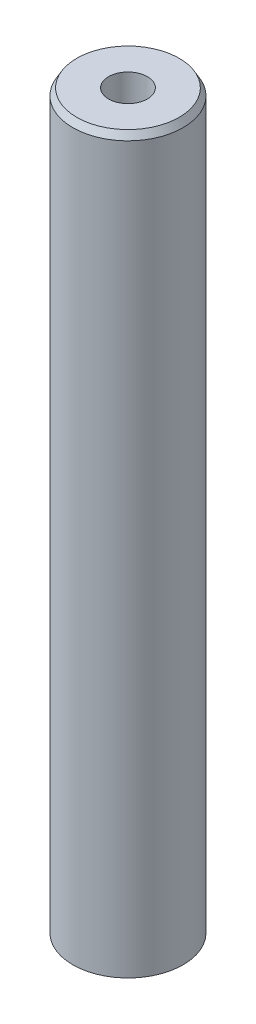
ISO-10303-21;
HEADER;
FILE_DESCRIPTION(('STEP AP214'),'2;1');
FILE_NAME('part.step','',(''),(''),'','','');
FILE_SCHEMA(('AUTOMOTIVE_DESIGN { 1 0 10303 214 1 1 1 1 }'));
ENDSEC;
DATA;
#1=APPLICATION_CONTEXT('core data for automotive mechanical design processes');
#2=APPLICATION_PROTOCOL_DEFINITION('international standard','automotive_design',2000,#1);
#3=PRODUCT_CONTEXT('',#1,'mechanical');
#4=PRODUCT('Part','Part','',(#3));
#5=PRODUCT_RELATED_PRODUCT_CATEGORY('part','',(#4));
#6=PRODUCT_DEFINITION_FORMATION('','',#4);
#7=PRODUCT_DEFINITION_CONTEXT('part definition',#1,'design');
#8=PRODUCT_DEFINITION('design','',#6,#7);
#9=PRODUCT_DEFINITION_SHAPE('','',#8);
#10=(LENGTH_UNIT() NAMED_UNIT(*) SI_UNIT(.MILLI.,.METRE.));
#11=(NAMED_UNIT(*) PLANE_ANGLE_UNIT() SI_UNIT($,.RADIAN.));
#12=(NAMED_UNIT(*) SI_UNIT($,.STERADIAN.) SOLID_ANGLE_UNIT());
#13=UNCERTAINTY_MEASURE_WITH_UNIT(LENGTH_MEASURE(1.E-05),#10,'distance_accuracy_value','');
#14=(GEOMETRIC_REPRESENTATION_CONTEXT(3) GLOBAL_UNCERTAINTY_ASSIGNED_CONTEXT((#13)) GLOBAL_UNIT_ASSIGNED_CONTEXT((#10,
#11,#12)) REPRESENTATION_CONTEXT('',''));
#15=CARTESIAN_POINT('',(0.,0.,0.));
#16=DIRECTION('',(0.,0.,1.));
#17=DIRECTION('',(1.,0.,0.));
#18=AXIS2_PLACEMENT_3D('',#15,#16,#17);
#19=CARTESIAN_POINT('',(0.,600.,0.));
#20=DIRECTION('',(0.,-1.,0.));
#21=DIRECTION('',(0.,0.,-1.));
#22=AXIS2_PLACEMENT_3D('',#19,#20,#21);
#23=CYLINDRICAL_SURFACE('',#22,45.);
#24=CARTESIAN_POINT('',(0.,594.360513745345,0.));
#25=DIRECTION('',(0.,1.,0.));
#26=DIRECTION('',(0.,0.,1.));
#27=AXIS2_PLACEMENT_3D('',#24,#25,#26);
#28=CIRCLE('',#27,45.);
#29=CARTESIAN_POINT('',(0.,594.360513745345,45.));
#30=VERTEX_POINT('',#29);
#31=EDGE_CURVE('E50',#30,#30,#28,.F.);
#32=ORIENTED_EDGE('',*,*,#31,.T.);
#33=EDGE_LOOP('',(#32));
#34=FACE_BOUND('',#33,.T.);
#35=CARTESIAN_POINT('',(0.,3.25595890721653,0.));
#36=DIRECTION('',(0.,1.,0.));
#37=DIRECTION('',(0.,0.,1.));
#38=AXIS2_PLACEMENT_3D('',#35,#36,#37);
#39=CIRCLE('',#38,45.);
#40=CARTESIAN_POINT('',(0.,3.25595890721653,45.));
#41=VERTEX_POINT('',#40);
#42=EDGE_CURVE('E51',#41,#41,#39,.T.);
#43=ORIENTED_EDGE('',*,*,#42,.T.);
#44=EDGE_LOOP('',(#43));
#45=FACE_BOUND('',#44,.T.);
#46=ADVANCED_FACE('F39',(#34,#45),#23,.T.);
#47=CARTESIAN_POINT('',(0.,600.,0.));
#48=DIRECTION('',(0.,1.,0.));
#49=DIRECTION('',(0.,0.,1.));
#50=AXIS2_PLACEMENT_3D('',#47,#48,#49);
#51=PLANE('',#50);
#52=CARTESIAN_POINT('',(0.,600.,0.));
#53=DIRECTION('',(0.,1.,0.));
#54=DIRECTION('',(0.,0.,1.));
#55=AXIS2_PLACEMENT_3D('',#52,#53,#54);
#56=CIRCLE('',#55,41.7440410927835);
#57=CARTESIAN_POINT('',(0.,600.,41.7440410927835));
#58=VERTEX_POINT('',#57);
#59=EDGE_CURVE('E54',#58,#58,#56,.T.);
#60=ORIENTED_EDGE('',*,*,#59,.T.);
#61=EDGE_LOOP('',(#60));
#62=FACE_BOUND('',#61,.T.);
#63=CARTESIAN_POINT('',(0.,600.,0.));
#64=DIRECTION('',(0.,1.,0.));
#65=DIRECTION('',(0.,0.,1.));
#66=AXIS2_PLACEMENT_3D('',#63,#64,#65);
#67=CIRCLE('',#66,15.8198269250848);
#68=CARTESIAN_POINT('',(0.,600.,15.8198269250848));
#69=VERTEX_POINT('',#68);
#70=EDGE_CURVE('E58',#69,#69,#67,.T.);
#71=ORIENTED_EDGE('',*,*,#70,.F.);
#72=EDGE_LOOP('',(#71));
#73=FACE_BOUND('',#72,.T.);
#74=ADVANCED_FACE('F69',(#62,#73),#51,.T.);
#75=CARTESIAN_POINT('',(0.,0.,0.));
#76=DIRECTION('',(0.,1.,0.));
#77=DIRECTION('',(0.,0.,1.));
#78=AXIS2_PLACEMENT_3D('',#75,#76,#77);
#79=PLANE('',#78);
#80=CARTESIAN_POINT('',(0.,0.,0.));
#81=DIRECTION('',(0.,1.,0.));
#82=DIRECTION('',(0.,0.,1.));
#83=AXIS2_PLACEMENT_3D('',#80,#81,#82);
#84=CIRCLE('',#83,39.3605137453445);
#85=CARTESIAN_POINT('',(0.,0.,39.3605137453445));
#86=VERTEX_POINT('',#85);
#87=EDGE_CURVE('E10',#86,#86,#84,.F.);
#88=ORIENTED_EDGE('',*,*,#87,.T.);
#89=EDGE_LOOP('',(#88));
#90=FACE_BOUND('',#89,.T.);
#91=CARTESIAN_POINT('',(0.,0.,0.));
#92=DIRECTION('',(0.,1.,0.));
#93=DIRECTION('',(0.,0.,1.));
#94=AXIS2_PLACEMENT_3D('',#91,#92,#93);
#95=CIRCLE('',#94,15.8198269250848);
#96=CARTESIAN_POINT('',(0.,0.,15.8198269250848));
#97=VERTEX_POINT('',#96);
#98=EDGE_CURVE('E63',#97,#97,#95,.T.);
#99=ORIENTED_EDGE('',*,*,#98,.T.);
#100=EDGE_LOOP('',(#99));
#101=FACE_BOUND('',#100,.T.);
#102=ADVANCED_FACE('F75',(#90,#101),#79,.F.);
#103=CARTESIAN_POINT('',(0.,600.,0.));
#104=DIRECTION('',(0.,-1.,0.));
#105=DIRECTION('',(0.,0.,-1.));
#106=AXIS2_PLACEMENT_3D('',#103,#104,#105);
#107=CYLINDRICAL_SURFACE('',#106,15.8198269250848);
#108=ORIENTED_EDGE('',*,*,#70,.T.);
#109=EDGE_LOOP('',(#108));
#110=FACE_BOUND('',#109,.T.);
#111=ORIENTED_EDGE('',*,*,#98,.F.);
#112=EDGE_LOOP('',(#111));
#113=FACE_BOUND('',#112,.T.);
#114=ADVANCED_FACE('F70',(#110,#113),#107,.F.);
#115=CARTESIAN_POINT('',(0.,600.,0.));
#116=DIRECTION('',(0.,-1.,0.));
#117=DIRECTION('',(0.,0.,-1.));
#118=AXIS2_PLACEMENT_3D('',#115,#116,#117);
#119=CONICAL_SURFACE('',#118,41.7440410927835,0.5235987755983);
#120=ORIENTED_EDGE('',*,*,#31,.F.);
#121=EDGE_LOOP('',(#120));
#122=FACE_BOUND('',#121,.T.);
#123=ORIENTED_EDGE('',*,*,#59,.F.);
#124=EDGE_LOOP('',(#123));
#125=FACE_BOUND('',#124,.T.);
#126=ADVANCED_FACE('F81',(#122,#125),#119,.T.);
#127=CARTESIAN_POINT('',(0.,3.25595890721653,0.));
#128=DIRECTION('',(0.,1.,0.));
#129=DIRECTION('',(0.,0.,1.));
#130=AXIS2_PLACEMENT_3D('',#127,#128,#129);
#131=CONICAL_SURFACE('',#130,45.,1.0471975511966);
#132=CARTESIAN_POINT('',(0.,0.,39.3605137453445));
#133=CARTESIAN_POINT('',(0.,0.03391623861684,39.4192583938305));
#134=CARTESIAN_POINT('',(0.,0.0678324772336783,39.4780030423165));
#135=CARTESIAN_POINT('',(0.,0.135664954467355,39.5954923392885));
#136=CARTESIAN_POINT('',(0.,0.169581193084193,39.6542369877745));
#137=CARTESIAN_POINT('',(0.,0.237413670317871,39.7717262847465));
#138=CARTESIAN_POINT('',(0.,0.27132990893471,39.8304709332324));
#139=CARTESIAN_POINT('',(0.,0.339162386168389,39.9479602302044));
#140=CARTESIAN_POINT('',(0.,0.373078624785227,40.0067048786904));
#141=CARTESIAN_POINT('',(0.,0.440911102018904,40.1241941756624));
#142=CARTESIAN_POINT('',(0.,0.474827340635742,40.1829388241484));
#143=CARTESIAN_POINT('',(0.,0.542659817869421,40.3004281211204));
#144=CARTESIAN_POINT('',(0.,0.57657605648626,40.3591727696064));
#145=CARTESIAN_POINT('',(0.,0.644408533719938,40.4766620665784));
#146=CARTESIAN_POINT('',(0.,0.678324772336776,40.5354067150644));
#147=CARTESIAN_POINT('',(0.,0.746157249570453,40.6528960120364));
#148=CARTESIAN_POINT('',(0.,0.780073488187293,40.7116406605224));
#149=CARTESIAN_POINT('',(0.,0.847905965420971,40.8291299574944));
#150=CARTESIAN_POINT('',(0.,0.881822204037809,40.8878746059804));
#151=CARTESIAN_POINT('',(0.,0.949654681271486,41.0053639029523));
#152=CARTESIAN_POINT('',(0.,0.983570919888325,41.0641085514383));
#153=CARTESIAN_POINT('',(0.,1.051403397122,41.1815978484103));
#154=CARTESIAN_POINT('',(0.,1.08531963573884,41.2403424968963));
#155=CARTESIAN_POINT('',(0.,1.15315211297252,41.3578317938683));
#156=CARTESIAN_POINT('',(0.,1.18706835158936,41.4165764423543));
#157=CARTESIAN_POINT('',(0.,1.25490082882304,41.5340657393263));
#158=CARTESIAN_POINT('',(0.,1.28881706743988,41.5928103878123));
#159=CARTESIAN_POINT('',(0.,1.35664954467355,41.7102996847843));
#160=CARTESIAN_POINT('',(0.,1.39056578329039,41.7690443332703));
#161=CARTESIAN_POINT('',(0.,1.45839826052407,41.8865336302423));
#162=CARTESIAN_POINT('',(0.,1.49231449914091,41.9452782787283));
#163=CARTESIAN_POINT('',(0.,1.56014697637459,42.0627675757003));
#164=CARTESIAN_POINT('',(0.,1.59406321499142,42.1215122241863));
#165=CARTESIAN_POINT('',(0.,1.6618956922251,42.2390015211582));
#166=CARTESIAN_POINT('',(0.,1.69581193084194,42.2977461696442));
#167=CARTESIAN_POINT('',(0.,1.76364440807562,42.4152354666162));
#168=CARTESIAN_POINT('',(0.,1.79756064669246,42.4739801151022));
#169=CARTESIAN_POINT('',(0.,1.86539312392614,42.5914694120742));
#170=CARTESIAN_POINT('',(0.,1.89930936254297,42.6502140605602));
#171=CARTESIAN_POINT('',(0.,1.96714183977665,42.7677033575322));
#172=CARTESIAN_POINT('',(0.,2.00105807839349,42.8264480060182));
#173=CARTESIAN_POINT('',(0.,2.06889055562717,42.9439373029902));
#174=CARTESIAN_POINT('',(0.,2.10280679424401,43.0026819514762));
#175=CARTESIAN_POINT('',(0.,2.17063927147769,43.1201712484482));
#176=CARTESIAN_POINT('',(0.,2.20455551009452,43.1789158969342));
#177=CARTESIAN_POINT('',(0.,2.2723879873282,43.2964051939062));
#178=CARTESIAN_POINT('',(0.,2.30630422594504,43.3551498423922));
#179=CARTESIAN_POINT('',(0.,2.37413670317872,43.4726391393641));
#180=CARTESIAN_POINT('',(0.,2.40805294179556,43.5313837878501));
#181=CARTESIAN_POINT('',(0.,2.47588541902923,43.6488730848221));
#182=CARTESIAN_POINT('',(0.,2.50980165764607,43.7076177333081));
#183=CARTESIAN_POINT('',(0.,2.57763413487975,43.8251070302801));
#184=CARTESIAN_POINT('',(0.,2.61155037349659,43.8838516787661));
#185=CARTESIAN_POINT('',(0.,2.67938285073027,44.0013409757381));
#186=CARTESIAN_POINT('',(0.,2.71329908934711,44.0600856242241));
#187=CARTESIAN_POINT('',(0.,2.78113156658078,44.1775749211961));
#188=CARTESIAN_POINT('',(0.,2.81504780519762,44.2363195696821));
#189=CARTESIAN_POINT('',(0.,2.8828802824313,44.3538088666541));
#190=CARTESIAN_POINT('',(0.,2.91679652104814,44.4125535151401));
#191=CARTESIAN_POINT('',(0.,2.98462899828182,44.530042812112));
#192=CARTESIAN_POINT('',(0.,3.01854523689865,44.588787460598));
#193=CARTESIAN_POINT('',(0.,3.08637771413233,44.70627675757));
#194=CARTESIAN_POINT('',(0.,3.12029395274917,44.765021406056));
#195=CARTESIAN_POINT('',(0.,3.18812642998285,44.882510703028));
#196=CARTESIAN_POINT('',(0.,3.22204266859969,44.941255351514));
#197=CARTESIAN_POINT('',(0.,3.25595890721653,45.));
#198=B_SPLINE_CURVE_WITH_KNOTS('',3,(#132,#133,#134,#135,#136,#137,#138,#139,#140,#141,#142,
#143,#144,#145,#146,#147,#148,#149,#150,#151,#152,#153,#154,#155,#156,#157,#158,#159,#160,#161,
#162,#163,#164,#165,#166,#167,#168,#169,#170,#171,#172,#173,#174,#175,#176,#177,#178,#179,#180,
#181,#182,#183,#184,#185,#186,#187,#188,#189,#190,#191,#192,#193,#194,#195,#196,#197),
.UNSPECIFIED.,.F.,.F.,(4,2,2,2,2,2,2,2,2,2,2,2,2,2,2,2,2,2,2,2,2,2,2,2,2,2,2,2,2,2,2,2,4),(0.,
0.203497431701031,0.406994863402067,0.610492295103098,0.813989726804134,1.01748715850517,
1.2209845902062,1.42448202190724,1.62797945360827,1.83147688530931,2.03497431701034,
2.23847174871137,2.44196918041241,2.64546661211344,2.84896404381448,3.05246147551551,
3.25595890721654,3.45945633891758,3.66295377061861,3.86645120231965,4.06994863402068,
4.27344606572172,4.47694349742275,4.68044092912379,4.88393836082482,5.08743579252585,
5.29093322422688,5.49443065592792,5.69792808762896,5.90142551932999,6.10492295103102,
6.30842038273205,6.51191781443309),.UNSPECIFIED.);
#199=EDGE_CURVE('BSEAM45',#86,#41,#198,.T.);
#200=ORIENTED_EDGE('',*,*,#87,.F.);
#201=ORIENTED_EDGE('',*,*,#42,.F.);
#202=ORIENTED_EDGE('',*,*,#199,.T.);
#203=ORIENTED_EDGE('',*,*,#199,.F.);
#204=EDGE_LOOP('',(#200,#202,#201,#203));
#205=FACE_BOUND('',#204,.T.);
#206=ADVANCED_FACE('F45',(#205),#131,.T.);
#207=CLOSED_SHELL('',(#46,#74,#102,#114,#126,#206));
#208=MANIFOLD_SOLID_BREP('B2',#207);
#209=ADVANCED_BREP_SHAPE_REPRESENTATION('',(#18,#208),#14);
#210=SHAPE_DEFINITION_REPRESENTATION(#9,#209);
ENDSEC;
END-ISO-10303-21;
